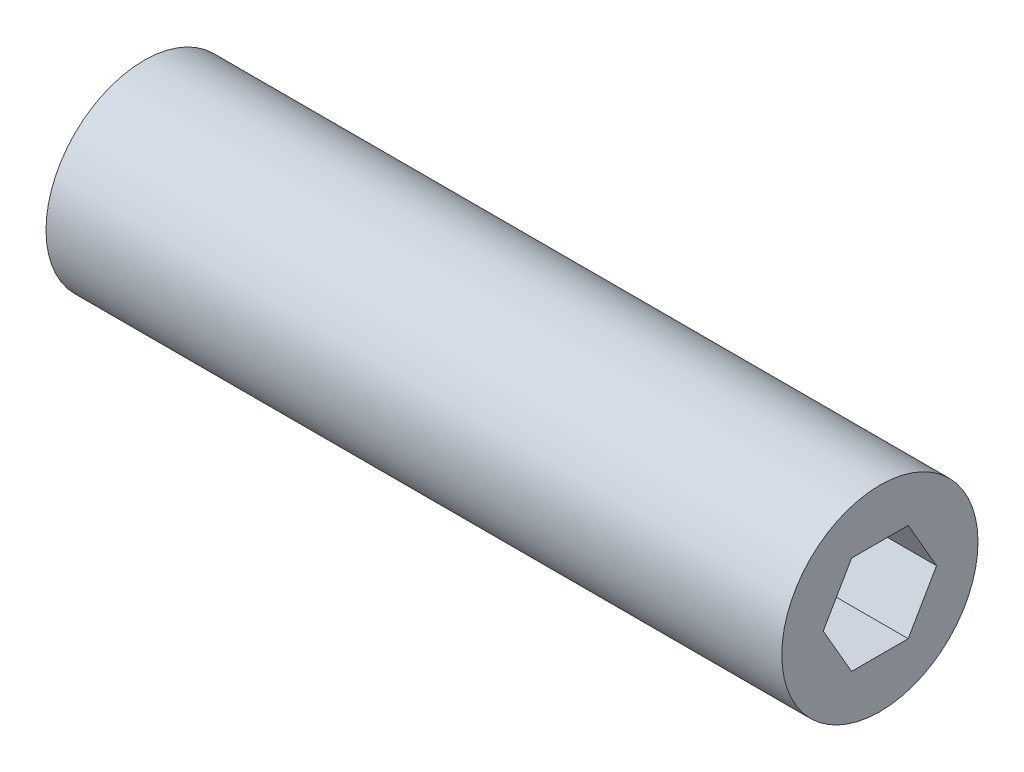
ISO-10303-21;
HEADER;
FILE_DESCRIPTION(('STEP AP214'),'2;1');
FILE_NAME('part.step','',(''),(''),'','','');
FILE_SCHEMA(('AUTOMOTIVE_DESIGN { 1 0 10303 214 1 1 1 1 }'));
ENDSEC;
DATA;
#1=APPLICATION_CONTEXT('core data for automotive mechanical design processes');
#2=APPLICATION_PROTOCOL_DEFINITION('international standard','automotive_design',2000,#1);
#3=PRODUCT_CONTEXT('',#1,'mechanical');
#4=PRODUCT('Part','Part','',(#3));
#5=PRODUCT_RELATED_PRODUCT_CATEGORY('part','',(#4));
#6=PRODUCT_DEFINITION_FORMATION('','',#4);
#7=PRODUCT_DEFINITION_CONTEXT('part definition',#1,'design');
#8=PRODUCT_DEFINITION('design','',#6,#7);
#9=PRODUCT_DEFINITION_SHAPE('','',#8);
#10=(LENGTH_UNIT() NAMED_UNIT(*) SI_UNIT(.MILLI.,.METRE.));
#11=(NAMED_UNIT(*) PLANE_ANGLE_UNIT() SI_UNIT($,.RADIAN.));
#12=(NAMED_UNIT(*) SI_UNIT($,.STERADIAN.) SOLID_ANGLE_UNIT());
#13=UNCERTAINTY_MEASURE_WITH_UNIT(LENGTH_MEASURE(1.E-05),#10,'distance_accuracy_value','');
#14=(GEOMETRIC_REPRESENTATION_CONTEXT(3) GLOBAL_UNCERTAINTY_ASSIGNED_CONTEXT((#13)) GLOBAL_UNIT_ASSIGNED_CONTEXT((#10,
#11,#12)) REPRESENTATION_CONTEXT('',''));
#15=CARTESIAN_POINT('',(0.,0.,0.));
#16=DIRECTION('',(0.,0.,1.));
#17=DIRECTION('',(1.,0.,0.));
#18=AXIS2_PLACEMENT_3D('',#15,#16,#17);
#19=CARTESIAN_POINT('',(60.,0.,0.));
#20=DIRECTION('',(1.,0.,0.));
#21=DIRECTION('',(0.,0.,-1.));
#22=AXIS2_PLACEMENT_3D('',#19,#20,#21);
#23=CYLINDRICAL_SURFACE('',#22,2.);
#24=CARTESIAN_POINT('',(60.,0.,0.));
#25=DIRECTION('',(1.,0.,0.));
#26=DIRECTION('',(0.,0.,-1.));
#27=AXIS2_PLACEMENT_3D('',#24,#25,#26);
#28=CIRCLE('',#27,2.);
#29=CARTESIAN_POINT('',(60.,0.,-2.));
#30=VERTEX_POINT('',#29);
#31=EDGE_CURVE('E11',#30,#30,#28,.T.);
#32=ORIENTED_EDGE('',*,*,#31,.T.);
#33=EDGE_LOOP('',(#32));
#34=FACE_BOUND('',#33,.T.);
#35=CARTESIAN_POINT('',(75.,0.,0.));
#36=DIRECTION('',(1.,0.,0.));
#37=DIRECTION('',(0.,0.,-1.));
#38=AXIS2_PLACEMENT_3D('',#35,#36,#37);
#39=CIRCLE('',#38,2.);
#40=CARTESIAN_POINT('',(75.,0.,-2.));
#41=VERTEX_POINT('',#40);
#42=EDGE_CURVE('E40',#41,#41,#39,.T.);
#43=ORIENTED_EDGE('',*,*,#42,.F.);
#44=EDGE_LOOP('',(#43));
#45=FACE_BOUND('',#44,.T.);
#46=ADVANCED_FACE('F37',(#34,#45),#23,.T.);
#47=CARTESIAN_POINT('',(60.,0.,0.));
#48=DIRECTION('',(1.,0.,0.));
#49=DIRECTION('',(0.,0.,-1.));
#50=AXIS2_PLACEMENT_3D('',#47,#48,#49);
#51=PLANE('',#50);
#52=DIRECTION('',(0.,-0.866025403784439,-0.5));
#53=VECTOR('',#52,1.);
#54=CARTESIAN_POINT('',(60.,0.,1.15470053837925));
#55=LINE('',#54,#53);
#56=CARTESIAN_POINT('',(60.,0.,1.15470053837925));
#57=VERTEX_POINT('',#56);
#58=CARTESIAN_POINT('',(60.,-1.,0.577350269189626));
#59=VERTEX_POINT('',#58);
#60=EDGE_CURVE('E97',#57,#59,#55,.T.);
#61=ORIENTED_EDGE('',*,*,#60,.T.);
#62=DIRECTION('',(0.,0.,-1.));
#63=VECTOR('',#62,1.);
#64=CARTESIAN_POINT('',(60.,-1.,0.577350269189626));
#65=LINE('',#64,#63);
#66=CARTESIAN_POINT('',(60.,-1.,-0.577350269189626));
#67=VERTEX_POINT('',#66);
#68=EDGE_CURVE('E91',#59,#67,#65,.T.);
#69=ORIENTED_EDGE('',*,*,#68,.T.);
#70=DIRECTION('',(0.,0.866025403784439,-0.5));
#71=VECTOR('',#70,1.);
#72=CARTESIAN_POINT('',(60.,-1.,-0.577350269189626));
#73=LINE('',#72,#71);
#74=CARTESIAN_POINT('',(60.,0.,-1.15470053837925));
#75=VERTEX_POINT('',#74);
#76=EDGE_CURVE('E100',#67,#75,#73,.T.);
#77=ORIENTED_EDGE('',*,*,#76,.T.);
#78=DIRECTION('',(0.,0.866025403784439,0.5));
#79=VECTOR('',#78,1.);
#80=CARTESIAN_POINT('',(60.,0.,-1.15470053837925));
#81=LINE('',#80,#79);
#82=CARTESIAN_POINT('',(60.,1.,-0.577350269189625));
#83=VERTEX_POINT('',#82);
#84=EDGE_CURVE('E51',#75,#83,#81,.T.);
#85=ORIENTED_EDGE('',*,*,#84,.T.);
#86=DIRECTION('',(0.,0.,1.));
#87=VECTOR('',#86,1.);
#88=CARTESIAN_POINT('',(60.,1.,-0.577350269189625));
#89=LINE('',#88,#87);
#90=CARTESIAN_POINT('',(60.,1.,0.577350269189626));
#91=VERTEX_POINT('',#90);
#92=EDGE_CURVE('E115',#83,#91,#89,.T.);
#93=ORIENTED_EDGE('',*,*,#92,.T.);
#94=DIRECTION('',(0.,-0.866025403784439,0.5));
#95=VECTOR('',#94,1.);
#96=CARTESIAN_POINT('',(60.,1.,0.577350269189626));
#97=LINE('',#96,#95);
#98=EDGE_CURVE('E118',#91,#57,#97,.T.);
#99=ORIENTED_EDGE('',*,*,#98,.T.);
#100=EDGE_LOOP('',(#61,#69,#77,#85,#93,#99));
#101=FACE_BOUND('',#100,.T.);
#102=ORIENTED_EDGE('',*,*,#31,.F.);
#103=EDGE_LOOP('',(#102));
#104=FACE_BOUND('',#103,.T.);
#105=ADVANCED_FACE('F104',(#101,#104),#51,.F.);
#106=CARTESIAN_POINT('',(75.,0.,0.));
#107=DIRECTION('',(1.,0.,0.));
#108=DIRECTION('',(0.,0.,-1.));
#109=AXIS2_PLACEMENT_3D('',#106,#107,#108);
#110=PLANE('',#109);
#111=DIRECTION('',(0.,0.,-1.));
#112=VECTOR('',#111,1.);
#113=CARTESIAN_POINT('',(75.,-1.,0.577350269189626));
#114=LINE('',#113,#112);
#115=CARTESIAN_POINT('',(75.,-1.,0.577350269189626));
#116=VERTEX_POINT('',#115);
#117=CARTESIAN_POINT('',(75.,-1.,-0.577350269189626));
#118=VERTEX_POINT('',#117);
#119=EDGE_CURVE('E59',#116,#118,#114,.T.);
#120=ORIENTED_EDGE('',*,*,#119,.F.);
#121=DIRECTION('',(0.,-0.866025403784439,-0.5));
#122=VECTOR('',#121,1.);
#123=CARTESIAN_POINT('',(75.,0.,1.15470053837925));
#124=LINE('',#123,#122);
#125=CARTESIAN_POINT('',(75.,0.,1.15470053837925));
#126=VERTEX_POINT('',#125);
#127=EDGE_CURVE('E108',#126,#116,#124,.T.);
#128=ORIENTED_EDGE('',*,*,#127,.F.);
#129=DIRECTION('',(0.,-0.866025403784439,0.5));
#130=VECTOR('',#129,1.);
#131=CARTESIAN_POINT('',(75.,1.,0.577350269189626));
#132=LINE('',#131,#130);
#133=CARTESIAN_POINT('',(75.,1.,0.577350269189626));
#134=VERTEX_POINT('',#133);
#135=EDGE_CURVE('E111',#134,#126,#132,.T.);
#136=ORIENTED_EDGE('',*,*,#135,.F.);
#137=DIRECTION('',(0.,0.,1.));
#138=VECTOR('',#137,1.);
#139=CARTESIAN_POINT('',(75.,1.,-0.577350269189625));
#140=LINE('',#139,#138);
#141=CARTESIAN_POINT('',(75.,1.,-0.577350269189625));
#142=VERTEX_POINT('',#141);
#143=EDGE_CURVE('E127',#142,#134,#140,.T.);
#144=ORIENTED_EDGE('',*,*,#143,.F.);
#145=DIRECTION('',(0.,0.866025403784439,0.5));
#146=VECTOR('',#145,1.);
#147=CARTESIAN_POINT('',(75.,0.,-1.15470053837925));
#148=LINE('',#147,#146);
#149=CARTESIAN_POINT('',(75.,0.,-1.15470053837925));
#150=VERTEX_POINT('',#149);
#151=EDGE_CURVE('E124',#150,#142,#148,.T.);
#152=ORIENTED_EDGE('',*,*,#151,.F.);
#153=DIRECTION('',(0.,0.866025403784439,-0.5));
#154=VECTOR('',#153,1.);
#155=CARTESIAN_POINT('',(75.,-1.,-0.577350269189626));
#156=LINE('',#155,#154);
#157=EDGE_CURVE('E122',#118,#150,#156,.T.);
#158=ORIENTED_EDGE('',*,*,#157,.F.);
#159=EDGE_LOOP('',(#120,#128,#136,#144,#152,#158));
#160=FACE_BOUND('',#159,.T.);
#161=ORIENTED_EDGE('',*,*,#42,.T.);
#162=EDGE_LOOP('',(#161));
#163=FACE_BOUND('',#162,.T.);
#164=ADVANCED_FACE('F144',(#160,#163),#110,.T.);
#165=CARTESIAN_POINT('',(60.,-1.,0.577350269189626));
#166=DIRECTION('',(0.,-1.,0.));
#167=DIRECTION('',(0.,0.,-1.));
#168=AXIS2_PLACEMENT_3D('',#165,#166,#167);
#169=PLANE('',#168);
#170=ORIENTED_EDGE('',*,*,#119,.T.);
#171=DIRECTION('',(1.,0.,0.));
#172=VECTOR('',#171,1.);
#173=CARTESIAN_POINT('',(60.,-1.,-0.577350269189626));
#174=LINE('',#173,#172);
#175=EDGE_CURVE('E87',#67,#118,#174,.T.);
#176=ORIENTED_EDGE('',*,*,#175,.F.);
#177=ORIENTED_EDGE('',*,*,#68,.F.);
#178=DIRECTION('',(1.,0.,0.));
#179=VECTOR('',#178,1.);
#180=CARTESIAN_POINT('',(60.,-1.,0.577350269189626));
#181=LINE('',#180,#179);
#182=EDGE_CURVE('E132',#59,#116,#181,.T.);
#183=ORIENTED_EDGE('',*,*,#182,.T.);
#184=EDGE_LOOP('',(#170,#176,#177,#183));
#185=FACE_BOUND('',#184,.T.);
#186=ADVANCED_FACE('F89',(#185),#169,.F.);
#187=CARTESIAN_POINT('',(60.,0.,1.15470053837925));
#188=DIRECTION('',(0.,-0.5,0.866025403784439));
#189=DIRECTION('',(0.,-0.866025403784439,-0.5));
#190=AXIS2_PLACEMENT_3D('',#187,#188,#189);
#191=PLANE('',#190);
#192=ORIENTED_EDGE('',*,*,#127,.T.);
#193=ORIENTED_EDGE('',*,*,#182,.F.);
#194=ORIENTED_EDGE('',*,*,#60,.F.);
#195=DIRECTION('',(1.,0.,0.));
#196=VECTOR('',#195,1.);
#197=CARTESIAN_POINT('',(60.,0.,1.15470053837925));
#198=LINE('',#197,#196);
#199=EDGE_CURVE('E134',#57,#126,#198,.T.);
#200=ORIENTED_EDGE('',*,*,#199,.T.);
#201=EDGE_LOOP('',(#192,#193,#194,#200));
#202=FACE_BOUND('',#201,.T.);
#203=ADVANCED_FACE('F155',(#202),#191,.F.);
#204=CARTESIAN_POINT('',(60.,1.,0.577350269189626));
#205=DIRECTION('',(0.,0.5,0.866025403784439));
#206=DIRECTION('',(0.,-0.866025403784439,0.5));
#207=AXIS2_PLACEMENT_3D('',#204,#205,#206);
#208=PLANE('',#207);
#209=ORIENTED_EDGE('',*,*,#135,.T.);
#210=ORIENTED_EDGE('',*,*,#199,.F.);
#211=ORIENTED_EDGE('',*,*,#98,.F.);
#212=DIRECTION('',(1.,0.,0.));
#213=VECTOR('',#212,1.);
#214=CARTESIAN_POINT('',(60.,1.,0.577350269189626));
#215=LINE('',#214,#213);
#216=EDGE_CURVE('E136',#91,#134,#215,.T.);
#217=ORIENTED_EDGE('',*,*,#216,.T.);
#218=EDGE_LOOP('',(#209,#210,#211,#217));
#219=FACE_BOUND('',#218,.T.);
#220=ADVANCED_FACE('F153',(#219),#208,.F.);
#221=CARTESIAN_POINT('',(60.,1.,-0.577350269189625));
#222=DIRECTION('',(0.,1.,0.));
#223=DIRECTION('',(0.,0.,1.));
#224=AXIS2_PLACEMENT_3D('',#221,#222,#223);
#225=PLANE('',#224);
#226=ORIENTED_EDGE('',*,*,#143,.T.);
#227=ORIENTED_EDGE('',*,*,#216,.F.);
#228=ORIENTED_EDGE('',*,*,#92,.F.);
#229=DIRECTION('',(1.,0.,0.));
#230=VECTOR('',#229,1.);
#231=CARTESIAN_POINT('',(60.,1.,-0.577350269189625));
#232=LINE('',#231,#230);
#233=EDGE_CURVE('E138',#83,#142,#232,.T.);
#234=ORIENTED_EDGE('',*,*,#233,.T.);
#235=EDGE_LOOP('',(#226,#227,#228,#234));
#236=FACE_BOUND('',#235,.T.);
#237=ADVANCED_FACE('F149',(#236),#225,.F.);
#238=CARTESIAN_POINT('',(60.,0.,-1.15470053837925));
#239=DIRECTION('',(0.,0.5,-0.866025403784439));
#240=DIRECTION('',(0.,0.866025403784439,0.5));
#241=AXIS2_PLACEMENT_3D('',#238,#239,#240);
#242=PLANE('',#241);
#243=ORIENTED_EDGE('',*,*,#151,.T.);
#244=ORIENTED_EDGE('',*,*,#233,.F.);
#245=ORIENTED_EDGE('',*,*,#84,.F.);
#246=DIRECTION('',(1.,0.,0.));
#247=VECTOR('',#246,1.);
#248=CARTESIAN_POINT('',(60.,0.,-1.15470053837925));
#249=LINE('',#248,#247);
#250=EDGE_CURVE('E96',#75,#150,#249,.T.);
#251=ORIENTED_EDGE('',*,*,#250,.T.);
#252=EDGE_LOOP('',(#243,#244,#245,#251));
#253=FACE_BOUND('',#252,.T.);
#254=ADVANCED_FACE('F140',(#253),#242,.F.);
#255=CARTESIAN_POINT('',(60.,-1.,-0.577350269189626));
#256=DIRECTION('',(0.,-0.5,-0.866025403784439));
#257=DIRECTION('',(0.,0.866025403784439,-0.5));
#258=AXIS2_PLACEMENT_3D('',#255,#256,#257);
#259=PLANE('',#258);
#260=ORIENTED_EDGE('',*,*,#157,.T.);
#261=ORIENTED_EDGE('',*,*,#250,.F.);
#262=ORIENTED_EDGE('',*,*,#76,.F.);
#263=ORIENTED_EDGE('',*,*,#175,.T.);
#264=EDGE_LOOP('',(#260,#261,#262,#263));
#265=FACE_BOUND('',#264,.T.);
#266=ADVANCED_FACE('F101',(#265),#259,.F.);
#267=CLOSED_SHELL('',(#46,#105,#164,#186,#203,#220,#237,#254,#266));
#268=MANIFOLD_SOLID_BREP('B2',#267);
#269=ADVANCED_BREP_SHAPE_REPRESENTATION('',(#18,#268),#14);
#270=SHAPE_DEFINITION_REPRESENTATION(#9,#269);
ENDSEC;
END-ISO-10303-21;
